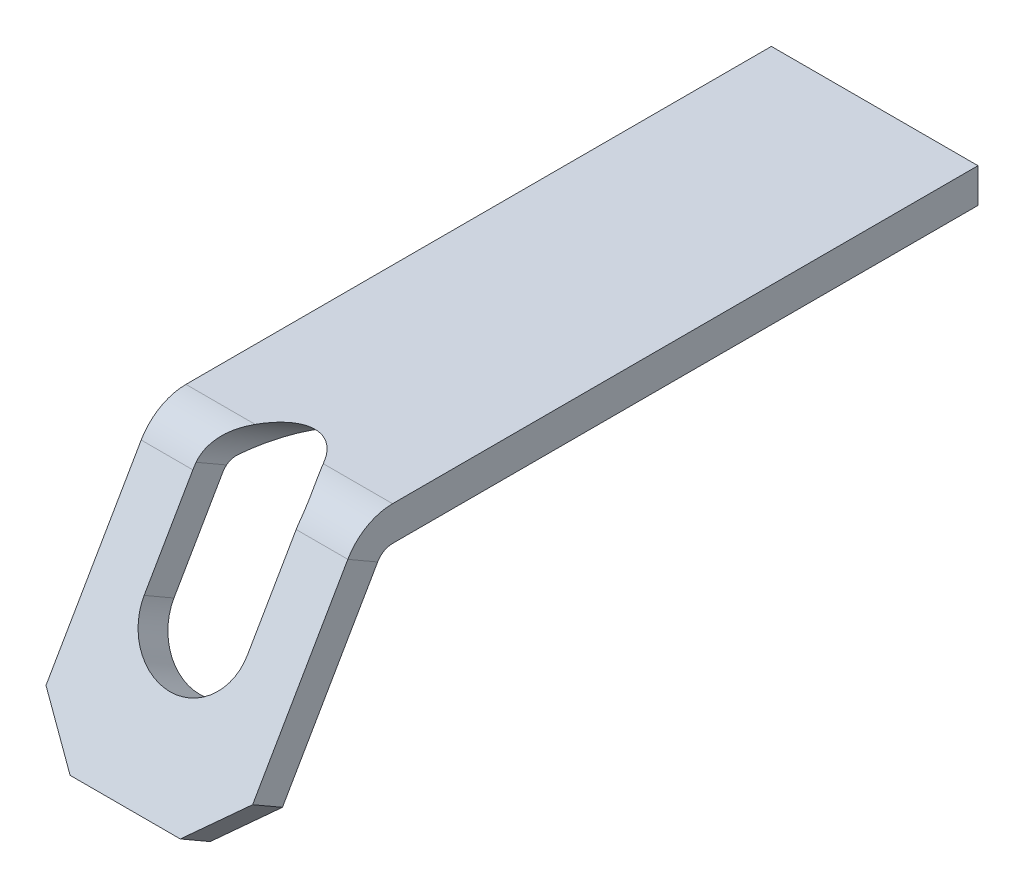
ISO-10303-21;
HEADER;
FILE_DESCRIPTION(('STEP AP214'),'2;1');
FILE_NAME('part.step','',(''),(''),'','','');
FILE_SCHEMA(('AUTOMOTIVE_DESIGN { 1 0 10303 214 1 1 1 1 }'));
ENDSEC;
DATA;
#1=APPLICATION_CONTEXT('core data for automotive mechanical design processes');
#2=APPLICATION_PROTOCOL_DEFINITION('international standard','automotive_design',2000,#1);
#3=PRODUCT_CONTEXT('',#1,'mechanical');
#4=PRODUCT('Part','Part','',(#3));
#5=PRODUCT_RELATED_PRODUCT_CATEGORY('part','',(#4));
#6=PRODUCT_DEFINITION_FORMATION('','',#4);
#7=PRODUCT_DEFINITION_CONTEXT('part definition',#1,'design');
#8=PRODUCT_DEFINITION('design','',#6,#7);
#9=PRODUCT_DEFINITION_SHAPE('','',#8);
#10=(LENGTH_UNIT() NAMED_UNIT(*) SI_UNIT(.MILLI.,.METRE.));
#11=(NAMED_UNIT(*) PLANE_ANGLE_UNIT() SI_UNIT($,.RADIAN.));
#12=(NAMED_UNIT(*) SI_UNIT($,.STERADIAN.) SOLID_ANGLE_UNIT());
#13=UNCERTAINTY_MEASURE_WITH_UNIT(LENGTH_MEASURE(1.E-05),#10,'distance_accuracy_value','');
#14=(GEOMETRIC_REPRESENTATION_CONTEXT(3) GLOBAL_UNCERTAINTY_ASSIGNED_CONTEXT((#13)) GLOBAL_UNIT_ASSIGNED_CONTEXT((#10,
#11,#12)) REPRESENTATION_CONTEXT('',''));
#15=CARTESIAN_POINT('',(0.,0.,0.));
#16=DIRECTION('',(0.,0.,1.));
#17=DIRECTION('',(1.,0.,0.));
#18=AXIS2_PLACEMENT_3D('',#15,#16,#17);
#19=CARTESIAN_POINT('',(0.,-0.5,4.25));
#20=DIRECTION('',(1.,0.,0.));
#21=DIRECTION('',(0.,0.,-1.));
#22=AXIS2_PLACEMENT_3D('',#19,#20,#21);
#23=CYLINDRICAL_SURFACE('',#22,0.25);
#24=CARTESIAN_POINT('',(0.738540154084688,-0.25,4.25));
#25=CARTESIAN_POINT('',(0.739796227190586,-0.249992222476748,4.26423192600012));
#26=CARTESIAN_POINT('',(0.741136393695474,-0.251215674942695,4.27845228618072));
#27=CARTESIAN_POINT('',(0.743704492818735,-0.255982139403662,4.30608304503192));
#28=CARTESIAN_POINT('',(0.74493454642555,-0.2594573169147,4.31950497559517));
#29=CARTESIAN_POINT('',(0.747172335123278,-0.268891956089954,4.34646595481917));
#30=CARTESIAN_POINT('',(0.748160348429003,-0.274998607282581,4.35995559261057));
#31=CARTESIAN_POINT('',(0.749588900459598,-0.289725386987503,4.38608332336731));
#32=CARTESIAN_POINT('',(0.750011148585141,-0.298418856822308,4.3986810266524));
#33=CARTESIAN_POINT('',(0.75,-0.308220009215909,4.41037591818866));
#34=B_SPLINE_CURVE_WITH_KNOTS('',3,(#24,#25,#26,#27,#28,#29,#30,#31,#32,#33),.UNSPECIFIED.,.F.,
.F.,(4,2,2,2,4),(0.,0.0428026914059938,0.0843723717900828,0.128652135829097,0.174331417159321),.UNSPECIFIED.);
#35=CARTESIAN_POINT('',(0.738540154084688,-0.25,4.25));
#36=VERTEX_POINT('',#35);
#37=CARTESIAN_POINT('',(0.75,-0.308220009215908,4.41037591818866));
#38=VERTEX_POINT('',#37);
#39=EDGE_CURVE('E316',#36,#38,#34,.T.);
#40=ORIENTED_EDGE('',*,*,#39,.F.);
#41=DIRECTION('',(1.,0.,0.));
#42=VECTOR('',#41,1.);
#43=CARTESIAN_POINT('',(-1.5,-0.25,4.25));
#44=LINE('',#43,#42);
#45=CARTESIAN_POINT('',(1.5,-0.25,4.25));
#46=VERTEX_POINT('',#45);
#47=EDGE_CURVE('E315',#36,#46,#44,.T.);
#48=ORIENTED_EDGE('',*,*,#47,.T.);
#49=CARTESIAN_POINT('',(1.5,-0.5,4.25));
#50=DIRECTION('',(1.,0.,0.));
#51=DIRECTION('',(0.,1.,0.));
#52=AXIS2_PLACEMENT_3D('',#49,#50,#51);
#53=CIRCLE('',#52,0.25);
#54=CARTESIAN_POINT('',(1.5,-0.375,4.46650635094611));
#55=VERTEX_POINT('',#54);
#56=EDGE_CURVE('E341',#46,#55,#53,.T.);
#57=ORIENTED_EDGE('',*,*,#56,.T.);
#58=DIRECTION('',(1.,0.,0.));
#59=VECTOR('',#58,1.);
#60=CARTESIAN_POINT('',(-1.5,-0.375,4.46650635094611));
#61=LINE('',#60,#59);
#62=CARTESIAN_POINT('',(0.75,-0.375,4.46650635094611));
#63=VERTEX_POINT('',#62);
#64=EDGE_CURVE('E330',#63,#55,#61,.T.);
#65=ORIENTED_EDGE('',*,*,#64,.F.);
#66=CARTESIAN_POINT('',(0.75,-0.5,4.25));
#67=DIRECTION('',(1.,0.,0.));
#68=DIRECTION('',(0.,0.,-1.));
#69=AXIS2_PLACEMENT_3D('',#66,#67,#68);
#70=CIRCLE('',#69,0.25);
#71=EDGE_CURVE('E204',#38,#63,#70,.T.);
#72=ORIENTED_EDGE('',*,*,#71,.F.);
#73=EDGE_LOOP('',(#40,#48,#57,#65,#72));
#74=FACE_BOUND('',#73,.T.);
#75=ADVANCED_FACE('F33',(#74),#23,.F.);
#76=CARTESIAN_POINT('',(0.,-0.5,4.25));
#77=DIRECTION('',(1.,0.,0.));
#78=DIRECTION('',(0.,0.,-1.));
#79=AXIS2_PLACEMENT_3D('',#76,#77,#78);
#80=CYLINDRICAL_SURFACE('',#79,0.75);
#81=CARTESIAN_POINT('',(0.75,-0.0530774463347981,4.85229580027208));
#82=CARTESIAN_POINT('',(0.750002475309161,-0.0390500007812527,4.84189012408484));
#83=CARTESIAN_POINT('',(0.749397484850658,-0.0253996458115997,4.83099771523583));
#84=CARTESIAN_POINT('',(0.747030547301498,0.00104006971930772,4.8083555069125));
#85=CARTESIAN_POINT('',(0.745269813605595,0.0138303177827564,4.79660661812892));
#86=CARTESIAN_POINT('',(0.738388136393959,0.0505308719127275,4.7604737016062));
#87=CARTESIAN_POINT('',(0.731665075692414,0.0730740166895009,4.73497676608455));
#88=CARTESIAN_POINT('',(0.714670479663492,0.113924752364809,4.68210224166803));
#89=CARTESIAN_POINT('',(0.704412929418581,0.132248568388786,4.65473240041221));
#90=CARTESIAN_POINT('',(0.681092480512217,0.164811508788652,4.59868326911695));
#91=CARTESIAN_POINT('',(0.668020265449992,0.179036692146175,4.56999988576025));
#92=CARTESIAN_POINT('',(0.63361768347433,0.2088635379017,4.49914580377907));
#93=CARTESIAN_POINT('',(0.611187373419911,0.222307050936848,4.45660414355653));
#94=CARTESIAN_POINT('',(0.564129396140941,0.241456718121171,4.37110856302409));
#95=CARTESIAN_POINT('',(0.539503361307708,0.247168570016325,4.3281549698181));
#96=CARTESIAN_POINT('',(0.508168812013807,0.249724148600028,4.27340370863223));
#97=CARTESIAN_POINT('',(0.501476538124168,0.249996949131605,4.26170462495713));
#98=CARTESIAN_POINT('',(0.494804752028709,0.250000000000006,4.25));
#99=B_SPLINE_CURVE_WITH_KNOTS('',3,(#81,#82,#83,#84,#85,#86,#87,#88,#89,#90,#91,#92,#93,#94,#95,
#96,#97,#98),.UNSPECIFIED.,.F.,.F.,(4,2,2,2,2,2,2,2,4),(0.,0.0523524240966635,0.104649972016483,
0.208128032232243,0.311201270134959,0.4146210689264,0.563636486235141,0.712542028697262,
0.752971410406567),.UNSPECIFIED.);
#100=CARTESIAN_POINT('',(0.75,-0.0530774463347985,4.85229580027207));
#101=VERTEX_POINT('',#100);
#102=CARTESIAN_POINT('',(0.494804752028707,0.25,4.25));
#103=VERTEX_POINT('',#102);
#104=EDGE_CURVE('E241',#101,#103,#99,.T.);
#105=ORIENTED_EDGE('',*,*,#104,.F.);
#106=CARTESIAN_POINT('',(0.75,-0.5,4.25));
#107=DIRECTION('',(1.,0.,0.));
#108=DIRECTION('',(0.,0.,-1.));
#109=AXIS2_PLACEMENT_3D('',#106,#107,#108);
#110=CIRCLE('',#109,0.75);
#111=CARTESIAN_POINT('',(0.75,-0.125000000000001,4.89951905283833));
#112=VERTEX_POINT('',#111);
#113=EDGE_CURVE('E206',#112,#101,#110,.F.);
#114=ORIENTED_EDGE('',*,*,#113,.F.);
#115=DIRECTION('',(-1.,0.,0.));
#116=VECTOR('',#115,1.);
#117=CARTESIAN_POINT('',(1.5,-0.125000000000001,4.89951905283833));
#118=LINE('',#117,#116);
#119=CARTESIAN_POINT('',(1.5,-0.125000000000001,4.89951905283833));
#120=VERTEX_POINT('',#119);
#121=EDGE_CURVE('E338',#120,#112,#118,.T.);
#122=ORIENTED_EDGE('',*,*,#121,.F.);
#123=CARTESIAN_POINT('',(1.5,-0.5,4.25));
#124=DIRECTION('',(1.,0.,0.));
#125=DIRECTION('',(0.,1.,0.));
#126=AXIS2_PLACEMENT_3D('',#123,#124,#125);
#127=CIRCLE('',#126,0.75);
#128=CARTESIAN_POINT('',(1.5,0.25,4.25));
#129=VERTEX_POINT('',#128);
#130=EDGE_CURVE('E352',#129,#120,#127,.T.);
#131=ORIENTED_EDGE('',*,*,#130,.F.);
#132=DIRECTION('',(1.,0.,0.));
#133=VECTOR('',#132,1.);
#134=CARTESIAN_POINT('',(-1.5,0.25,4.25));
#135=LINE('',#134,#133);
#136=EDGE_CURVE('E369',#103,#129,#135,.T.);
#137=ORIENTED_EDGE('',*,*,#136,.F.);
#138=EDGE_LOOP('',(#105,#114,#122,#131,#137));
#139=FACE_BOUND('',#138,.T.);
#140=ADVANCED_FACE('F254',(#139),#80,.T.);
#141=CARTESIAN_POINT('',(1.5,0.25,-4.25));
#142=DIRECTION('',(-1.,0.,0.));
#143=DIRECTION('',(0.,0.,1.));
#144=AXIS2_PLACEMENT_3D('',#141,#142,#143);
#145=PLANE('',#144);
#146=DIRECTION('',(0.,0.,-1.));
#147=VECTOR('',#146,1.);
#148=CARTESIAN_POINT('',(1.5,-0.25,-4.25));
#149=LINE('',#148,#147);
#150=CARTESIAN_POINT('',(1.5,-0.25,-4.25));
#151=VERTEX_POINT('',#150);
#152=EDGE_CURVE('E361',#46,#151,#149,.T.);
#153=ORIENTED_EDGE('',*,*,#152,.T.);
#154=DIRECTION('',(0.,-1.,0.));
#155=VECTOR('',#154,1.);
#156=CARTESIAN_POINT('',(1.5,0.25,-4.25));
#157=LINE('',#156,#155);
#158=CARTESIAN_POINT('',(1.5,0.25,-4.25));
#159=VERTEX_POINT('',#158);
#160=EDGE_CURVE('E182',#159,#151,#157,.T.);
#161=ORIENTED_EDGE('',*,*,#160,.F.);
#162=DIRECTION('',(0.,0.,-1.));
#163=VECTOR('',#162,1.);
#164=CARTESIAN_POINT('',(1.5,0.25,-4.25));
#165=LINE('',#164,#163);
#166=EDGE_CURVE('E362',#129,#159,#165,.T.);
#167=ORIENTED_EDGE('',*,*,#166,.F.);
#168=ORIENTED_EDGE('',*,*,#130,.T.);
#169=DIRECTION('',(0.,0.5,0.866025403784439));
#170=VECTOR('',#169,1.);
#171=CARTESIAN_POINT('',(1.5,-0.375,4.46650635094611));
#172=LINE('',#171,#170);
#173=EDGE_CURVE('E344',#55,#120,#172,.T.);
#174=ORIENTED_EDGE('',*,*,#173,.F.);
#175=ORIENTED_EDGE('',*,*,#56,.F.);
#176=EDGE_LOOP('',(#153,#161,#167,#168,#174,#175));
#177=FACE_BOUND('',#176,.T.);
#178=ADVANCED_FACE('F277',(#177),#145,.F.);
#179=CARTESIAN_POINT('',(-1.5,0.25,-4.25));
#180=DIRECTION('',(0.,0.,1.));
#181=DIRECTION('',(1.,0.,0.));
#182=AXIS2_PLACEMENT_3D('',#179,#180,#181);
#183=PLANE('',#182);
#184=DIRECTION('',(-1.,0.,0.));
#185=VECTOR('',#184,1.);
#186=CARTESIAN_POINT('',(-1.5,-0.25,-4.25));
#187=LINE('',#186,#185);
#188=CARTESIAN_POINT('',(-1.5,-0.25,-4.25));
#189=VERTEX_POINT('',#188);
#190=EDGE_CURVE('E376',#151,#189,#187,.T.);
#191=ORIENTED_EDGE('',*,*,#190,.T.);
#192=DIRECTION('',(0.,-1.,0.));
#193=VECTOR('',#192,1.);
#194=CARTESIAN_POINT('',(-1.5,0.25,-4.25));
#195=LINE('',#194,#193);
#196=CARTESIAN_POINT('',(-1.5,0.25,-4.25));
#197=VERTEX_POINT('',#196);
#198=EDGE_CURVE('E373',#197,#189,#195,.T.);
#199=ORIENTED_EDGE('',*,*,#198,.F.);
#200=DIRECTION('',(-1.,0.,0.));
#201=VECTOR('',#200,1.);
#202=CARTESIAN_POINT('',(-1.5,0.25,-4.25));
#203=LINE('',#202,#201);
#204=EDGE_CURVE('E365',#159,#197,#203,.T.);
#205=ORIENTED_EDGE('',*,*,#204,.F.);
#206=ORIENTED_EDGE('',*,*,#160,.T.);
#207=EDGE_LOOP('',(#191,#199,#205,#206));
#208=FACE_BOUND('',#207,.T.);
#209=ADVANCED_FACE('F273',(#208),#183,.F.);
#210=CARTESIAN_POINT('',(-1.5,0.25,-4.25));
#211=DIRECTION('',(1.,0.,0.));
#212=DIRECTION('',(0.,0.,-1.));
#213=AXIS2_PLACEMENT_3D('',#210,#211,#212);
#214=PLANE('',#213);
#215=DIRECTION('',(0.,0.,1.));
#216=VECTOR('',#215,1.);
#217=CARTESIAN_POINT('',(-1.5,-0.25,-4.25));
#218=LINE('',#217,#216);
#219=CARTESIAN_POINT('',(-1.5,-0.25,4.25));
#220=VERTEX_POINT('',#219);
#221=EDGE_CURVE('E378',#189,#220,#218,.T.);
#222=ORIENTED_EDGE('',*,*,#221,.T.);
#223=CARTESIAN_POINT('',(-1.5,-0.5,4.25));
#224=DIRECTION('',(1.,0.,0.));
#225=DIRECTION('',(0.,1.,0.));
#226=AXIS2_PLACEMENT_3D('',#223,#224,#225);
#227=CIRCLE('',#226,0.25);
#228=CARTESIAN_POINT('',(-1.5,-0.375,4.46650635094611));
#229=VERTEX_POINT('',#228);
#230=EDGE_CURVE('E328',#220,#229,#227,.T.);
#231=ORIENTED_EDGE('',*,*,#230,.T.);
#232=DIRECTION('',(0.,-0.5,-0.866025403784439));
#233=VECTOR('',#232,1.);
#234=CARTESIAN_POINT('',(-1.5,-0.125000000000001,4.89951905283833));
#235=LINE('',#234,#233);
#236=CARTESIAN_POINT('',(-1.5,-0.125000000000001,4.89951905283833));
#237=VERTEX_POINT('',#236);
#238=EDGE_CURVE('E320',#237,#229,#235,.T.);
#239=ORIENTED_EDGE('',*,*,#238,.F.);
#240=CARTESIAN_POINT('',(-1.5,-0.5,4.25));
#241=DIRECTION('',(1.,0.,0.));
#242=DIRECTION('',(0.,1.,0.));
#243=AXIS2_PLACEMENT_3D('',#240,#241,#242);
#244=CIRCLE('',#243,0.75);
#245=CARTESIAN_POINT('',(-1.5,0.25,4.25));
#246=VERTEX_POINT('',#245);
#247=EDGE_CURVE('E317',#246,#237,#244,.T.);
#248=ORIENTED_EDGE('',*,*,#247,.F.);
#249=DIRECTION('',(0.,0.,1.));
#250=VECTOR('',#249,1.);
#251=CARTESIAN_POINT('',(-1.5,0.25,-4.25));
#252=LINE('',#251,#250);
#253=EDGE_CURVE('E367',#197,#246,#252,.T.);
#254=ORIENTED_EDGE('',*,*,#253,.F.);
#255=ORIENTED_EDGE('',*,*,#198,.T.);
#256=EDGE_LOOP('',(#222,#231,#239,#248,#254,#255));
#257=FACE_BOUND('',#256,.T.);
#258=ADVANCED_FACE('F266',(#257),#214,.F.);
#259=CARTESIAN_POINT('',(0.,0.25,0.));
#260=DIRECTION('',(0.,1.,0.));
#261=DIRECTION('',(0.,0.,1.));
#262=AXIS2_PLACEMENT_3D('',#259,#260,#261);
#263=PLANE('',#262);
#264=CARTESIAN_POINT('',(0.,0.25,5.37724133595217));
#265=DIRECTION('',(0.,1.,0.));
#266=DIRECTION('',(0.,0.,1.));
#267=AXIS2_PLACEMENT_3D('',#264,#265,#266);
#268=ELLIPSE('',#267,1.5,0.75);
#269=CARTESIAN_POINT('',(-0.494804752028707,0.25,4.25));
#270=VERTEX_POINT('',#269);
#271=EDGE_CURVE('E208',#103,#270,#268,.T.);
#272=ORIENTED_EDGE('',*,*,#271,.F.);
#273=ORIENTED_EDGE('',*,*,#136,.T.);
#274=ORIENTED_EDGE('',*,*,#166,.T.);
#275=ORIENTED_EDGE('',*,*,#204,.T.);
#276=ORIENTED_EDGE('',*,*,#253,.T.);
#277=EDGE_CURVE('E370',#246,#270,#135,.T.);
#278=ORIENTED_EDGE('',*,*,#277,.T.);
#279=EDGE_LOOP('',(#272,#273,#274,#275,#276,#278));
#280=FACE_BOUND('',#279,.T.);
#281=ADVANCED_FACE('F263',(#280),#263,.T.);
#282=CARTESIAN_POINT('',(0.,-0.25,0.));
#283=DIRECTION('',(0.,1.,0.));
#284=DIRECTION('',(0.,0.,1.));
#285=AXIS2_PLACEMENT_3D('',#282,#283,#284);
#286=PLANE('',#285);
#287=ORIENTED_EDGE('',*,*,#47,.F.);
#288=CARTESIAN_POINT('',(0.,-0.25,4.51121593216774));
#289=DIRECTION('',(0.,1.,0.));
#290=DIRECTION('',(0.,0.,1.));
#291=AXIS2_PLACEMENT_3D('',#288,#289,#290);
#292=ELLIPSE('',#291,1.5,0.75);
#293=CARTESIAN_POINT('',(-0.738540154084688,-0.25,4.25));
#294=VERTEX_POINT('',#293);
#295=EDGE_CURVE('E217',#36,#294,#292,.T.);
#296=ORIENTED_EDGE('',*,*,#295,.T.);
#297=EDGE_CURVE('E308',#220,#294,#44,.T.);
#298=ORIENTED_EDGE('',*,*,#297,.F.);
#299=ORIENTED_EDGE('',*,*,#221,.F.);
#300=ORIENTED_EDGE('',*,*,#190,.F.);
#301=ORIENTED_EDGE('',*,*,#152,.F.);
#302=EDGE_LOOP('',(#287,#296,#298,#299,#300,#301));
#303=FACE_BOUND('',#302,.T.);
#304=ADVANCED_FACE('F259',(#303),#286,.F.);
#305=CARTESIAN_POINT('',(0.,-3.25,6.4150635094611));
#306=DIRECTION('',(0.,-0.866025403784438,0.500000000000001));
#307=DIRECTION('',(1.,0.,0.));
#308=AXIS2_PLACEMENT_3D('',#305,#306,#307);
#309=PLANE('',#308);
#310=DIRECTION('',(1.,0.,0.));
#311=VECTOR('',#310,1.);
#312=CARTESIAN_POINT('',(-1.5,-3.375,6.198557158515));
#313=LINE('',#312,#311);
#314=CARTESIAN_POINT('',(-0.799999999999998,-3.375,6.198557158515));
#315=VERTEX_POINT('',#314);
#316=CARTESIAN_POINT('',(0.8,-3.375,6.198557158515));
#317=VERTEX_POINT('',#316);
#318=EDGE_CURVE('E334',#315,#317,#313,.T.);
#319=ORIENTED_EDGE('',*,*,#318,.T.);
#320=DIRECTION('',(0.,0.500000000000001,0.866025403784438));
#321=VECTOR('',#320,1.);
#322=CARTESIAN_POINT('',(0.8,-3.25,6.4150635094611));
#323=LINE('',#322,#321);
#324=CARTESIAN_POINT('',(0.8,-3.125,6.63156986040721));
#325=VERTEX_POINT('',#324);
#326=EDGE_CURVE('E400',#317,#325,#323,.T.);
#327=ORIENTED_EDGE('',*,*,#326,.T.);
#328=DIRECTION('',(-1.,0.,0.));
#329=VECTOR('',#328,1.);
#330=CARTESIAN_POINT('',(1.5,-3.125,6.63156986040721));
#331=LINE('',#330,#329);
#332=CARTESIAN_POINT('',(-0.799999999999998,-3.125,6.63156986040721));
#333=VERTEX_POINT('',#332);
#334=EDGE_CURVE('E357',#325,#333,#331,.T.);
#335=ORIENTED_EDGE('',*,*,#334,.T.);
#336=DIRECTION('',(0.,-0.500000000000001,-0.866025403784438));
#337=VECTOR('',#336,1.);
#338=CARTESIAN_POINT('',(-0.799999999999998,-3.25,6.4150635094611));
#339=LINE('',#338,#337);
#340=EDGE_CURVE('E246',#333,#315,#339,.T.);
#341=ORIENTED_EDGE('',*,*,#340,.T.);
#342=EDGE_LOOP('',(#319,#327,#335,#341));
#343=FACE_BOUND('',#342,.T.);
#344=ADVANCED_FACE('F229',(#343),#309,.T.);
#345=CARTESIAN_POINT('',(-0.75,-0.308220009215908,4.41037591818866));
#346=CARTESIAN_POINT('',(-0.750008310530121,-0.299170345690206,4.39957110118343));
#347=CARTESIAN_POINT('',(-0.7496493719506,-0.291061551564701,4.38799997393136));
#348=CARTESIAN_POINT('',(-0.748415678099862,-0.277104423632904,4.36403100034418));
#349=CARTESIAN_POINT('',(-0.747555891577427,-0.271198332145317,4.35166604883466));
#350=CARTESIAN_POINT('',(-0.745421239101967,-0.261037124809497,4.32496342703673));
#351=CARTESIAN_POINT('',(-0.744115010283401,-0.256988760900442,4.31054949871758));
#352=CARTESIAN_POINT('',(-0.741355473168162,-0.25142101625551,4.28077071335262));
#353=CARTESIAN_POINT('',(-0.739898791250124,-0.249986913345264,4.26539018443887));
#354=CARTESIAN_POINT('',(-0.738540154084688,-0.25,4.25));
#355=B_SPLINE_CURVE_WITH_KNOTS('',3,(#345,#346,#347,#348,#349,#350,#351,#352,#353,#354),
.UNSPECIFIED.,.F.,.F.,(4,2,2,2,4),(0.,0.0422016336722642,0.0832023760305246,0.128047888733355,
0.174331752280167),.UNSPECIFIED.);
#356=CARTESIAN_POINT('',(-0.75,-0.308220009215908,4.41037591818866));
#357=VERTEX_POINT('',#356);
#358=EDGE_CURVE('E210',#357,#294,#355,.T.);
#359=ORIENTED_EDGE('',*,*,#358,.F.);
#360=CARTESIAN_POINT('',(-0.75,-0.5,4.25));
#361=DIRECTION('',(-1.,0.,0.));
#362=DIRECTION('',(0.,-1.,0.));
#363=AXIS2_PLACEMENT_3D('',#360,#361,#362);
#364=CIRCLE('',#363,0.25);
#365=CARTESIAN_POINT('',(-0.75,-0.375,4.46650635094611));
#366=VERTEX_POINT('',#365);
#367=EDGE_CURVE('E198',#366,#357,#364,.T.);
#368=ORIENTED_EDGE('',*,*,#367,.F.);
#369=EDGE_CURVE('E339',#229,#366,#61,.T.);
#370=ORIENTED_EDGE('',*,*,#369,.F.);
#371=ORIENTED_EDGE('',*,*,#230,.F.);
#372=ORIENTED_EDGE('',*,*,#297,.T.);
#373=EDGE_LOOP('',(#359,#368,#370,#371,#372));
#374=FACE_BOUND('',#373,.T.);
#375=ADVANCED_FACE('F219',(#374),#23,.F.);
#376=CARTESIAN_POINT('',(-0.494804752028707,0.25,4.25));
#377=CARTESIAN_POINT('',(-0.507212223849995,0.24999104936502,4.27176544478382));
#378=CARTESIAN_POINT('',(-0.519677329562981,0.249052174133644,4.29348153759597));
#379=CARTESIAN_POINT('',(-0.544476505895984,0.245273819176751,4.33686353730328));
#380=CARTESIAN_POINT('',(-0.556810364065535,0.242431628285439,4.35852932830796));
#381=CARTESIAN_POINT('',(-0.593492984985001,0.230897623169133,4.42397071088134));
#382=CARTESIAN_POINT('',(-0.617199549117097,0.219196023208876,4.46764754407431));
#383=CARTESIAN_POINT('',(-0.655369353049871,0.191156681794535,4.54326612847591));
#384=CARTESIAN_POINT('',(-0.670675057728904,0.176653514513336,4.57546468892482));
#385=CARTESIAN_POINT('',(-0.697958612412823,0.142647605295805,4.63828922937357));
#386=CARTESIAN_POINT('',(-0.70996212874235,0.123185827280292,4.66892573721418));
#387=CARTESIAN_POINT('',(-0.729340509733132,0.0800406667948656,4.72675752132392));
#388=CARTESIAN_POINT('',(-0.736878604418717,0.0565530386505959,4.75404068185705));
#389=CARTESIAN_POINT('',(-0.744635583122395,0.0179834450445735,4.79270929564723));
#390=CARTESIAN_POINT('',(-0.746630830911752,0.00444936512402553,4.80531366677174));
#391=CARTESIAN_POINT('',(-0.749315579530813,-0.0236048687245404,4.82956257178275));
#392=CARTESIAN_POINT('',(-0.750003338619623,-0.0381263113268377,4.84120580560175));
#393=CARTESIAN_POINT('',(-0.75,-0.0530774463347993,4.85229580027208));
#394=B_SPLINE_CURVE_WITH_KNOTS('',3,(#376,#377,#378,#379,#380,#381,#382,#383,#384,#385,#386,
#387,#388,#389,#390,#391,#392,#393),.UNSPECIFIED.,.F.,.F.,(4,2,2,2,2,2,2,2,4),(0.,
0.0751135104377852,0.150334244069228,0.302651785589941,0.417705443137115,0.531837811097346,
0.641489009411778,0.697207014432039,0.752999191038594),.UNSPECIFIED.);
#395=CARTESIAN_POINT('',(-0.75,-0.0530774463347985,4.85229580027207));
#396=VERTEX_POINT('',#395);
#397=EDGE_CURVE('E181',#270,#396,#394,.T.);
#398=ORIENTED_EDGE('',*,*,#397,.F.);
#399=ORIENTED_EDGE('',*,*,#277,.F.);
#400=ORIENTED_EDGE('',*,*,#247,.T.);
#401=CARTESIAN_POINT('',(-0.75,-0.125000000000001,4.89951905283833));
#402=VERTEX_POINT('',#401);
#403=EDGE_CURVE('E355',#402,#237,#118,.T.);
#404=ORIENTED_EDGE('',*,*,#403,.F.);
#405=CARTESIAN_POINT('',(-0.75,-0.5,4.25));
#406=DIRECTION('',(-1.,0.,0.));
#407=DIRECTION('',(0.,-1.,0.));
#408=AXIS2_PLACEMENT_3D('',#405,#406,#407);
#409=CIRCLE('',#408,0.75);
#410=EDGE_CURVE('E178',#396,#402,#409,.F.);
#411=ORIENTED_EDGE('',*,*,#410,.F.);
#412=EDGE_LOOP('',(#398,#399,#400,#404,#411));
#413=FACE_BOUND('',#412,.T.);
#414=ADVANCED_FACE('F248',(#413),#80,.T.);
#415=CARTESIAN_POINT('',(-1.5,-0.125,4.89951905283833));
#416=DIRECTION('',(-1.,0.,0.));
#417=DIRECTION('',(0.,0.,1.));
#418=AXIS2_PLACEMENT_3D('',#415,#416,#417);
#419=PLANE('',#418);
#420=DIRECTION('',(0.,-0.866025403784438,0.500000000000001));
#421=VECTOR('',#420,1.);
#422=CARTESIAN_POINT('',(-1.5,-0.375,4.46650635094611));
#423=LINE('',#422,#421);
#424=CARTESIAN_POINT('',(-1.5,-2.76878221735089,5.84855715851499));
#425=VERTEX_POINT('',#424);
#426=EDGE_CURVE('E332',#229,#425,#423,.T.);
#427=ORIENTED_EDGE('',*,*,#426,.T.);
#428=DIRECTION('',(0.,0.500000000000001,0.866025403784438));
#429=VECTOR('',#428,1.);
#430=CARTESIAN_POINT('',(-1.5,-2.51878221735089,6.28156986040721));
#431=LINE('',#430,#429);
#432=CARTESIAN_POINT('',(-1.5,-2.51878221735089,6.28156986040721));
#433=VERTEX_POINT('',#432);
#434=EDGE_CURVE('E11',#425,#433,#431,.T.);
#435=ORIENTED_EDGE('',*,*,#434,.T.);
#436=DIRECTION('',(0.,-0.866025403784438,0.500000000000001));
#437=VECTOR('',#436,1.);
#438=CARTESIAN_POINT('',(-1.5,-0.125,4.89951905283833));
#439=LINE('',#438,#437);
#440=EDGE_CURVE('E335',#237,#433,#439,.T.);
#441=ORIENTED_EDGE('',*,*,#440,.F.);
#442=ORIENTED_EDGE('',*,*,#238,.T.);
#443=EDGE_LOOP('',(#427,#435,#441,#442));
#444=FACE_BOUND('',#443,.T.);
#445=ADVANCED_FACE('F231',(#444),#419,.T.);
#446=CARTESIAN_POINT('',(-1.5,-0.375,4.46650635094611));
#447=DIRECTION('',(0.,-0.500000000000001,-0.866025403784438));
#448=DIRECTION('',(0.,0.866025403784438,-0.500000000000001));
#449=AXIS2_PLACEMENT_3D('',#446,#447,#448);
#450=PLANE('',#449);
#451=DIRECTION('',(0.,-0.866025403784438,0.500000000000001));
#452=VECTOR('',#451,1.);
#453=CARTESIAN_POINT('',(1.5,-0.375,4.46650635094611));
#454=LINE('',#453,#452);
#455=CARTESIAN_POINT('',(1.5,-2.76878221735089,5.84855715851499));
#456=VERTEX_POINT('',#455);
#457=EDGE_CURVE('E347',#55,#456,#454,.T.);
#458=ORIENTED_EDGE('',*,*,#457,.T.);
#459=DIRECTION('',(0.707106781186546,0.612372435695796,-0.353553390593275));
#460=VECTOR('',#459,1.);
#461=CARTESIAN_POINT('',(1.38205080756888,-2.8709292143521,5.90753175473055));
#462=LINE('',#461,#460);
#463=EDGE_CURVE('E41',#456,#317,#462,.F.);
#464=ORIENTED_EDGE('',*,*,#463,.T.);
#465=ORIENTED_EDGE('',*,*,#318,.F.);
#466=DIRECTION('',(0.707106781186546,-0.612372435695796,0.353553390593275));
#467=VECTOR('',#466,1.);
#468=CARTESIAN_POINT('',(-2.88205080756888,-1.57189110867544,5.15753175473055));
#469=LINE('',#468,#467);
#470=EDGE_CURVE('E48',#315,#425,#469,.F.);
#471=ORIENTED_EDGE('',*,*,#470,.T.);
#472=ORIENTED_EDGE('',*,*,#426,.F.);
#473=ORIENTED_EDGE('',*,*,#369,.T.);
#474=DIRECTION('',(0.,0.866025403784438,-0.500000000000001));
#475=VECTOR('',#474,1.);
#476=CARTESIAN_POINT('',(-0.75,-0.375,4.46650635094611));
#477=LINE('',#476,#475);
#478=CARTESIAN_POINT('',(-0.75,-1.5996479222419,5.17355715851499));
#479=VERTEX_POINT('',#478);
#480=EDGE_CURVE('E194',#479,#366,#477,.T.);
#481=ORIENTED_EDGE('',*,*,#480,.F.);
#482=CARTESIAN_POINT('',(0.,-1.5996479222419,5.17355715851499));
#483=DIRECTION('',(0.,-0.500000000000001,-0.866025403784438));
#484=DIRECTION('',(0.,0.866025403784438,-0.500000000000001));
#485=AXIS2_PLACEMENT_3D('',#482,#483,#484);
#486=CIRCLE('',#485,0.75);
#487=CARTESIAN_POINT('',(0.75,-1.5996479222419,5.17355715851499));
#488=VERTEX_POINT('',#487);
#489=EDGE_CURVE('E167',#488,#479,#486,.T.);
#490=ORIENTED_EDGE('',*,*,#489,.F.);
#491=DIRECTION('',(0.,-0.866025403784438,0.500000000000001));
#492=VECTOR('',#491,1.);
#493=CARTESIAN_POINT('',(0.75,-0.375,4.46650635094611));
#494=LINE('',#493,#492);
#495=EDGE_CURVE('E202',#63,#488,#494,.T.);
#496=ORIENTED_EDGE('',*,*,#495,.F.);
#497=ORIENTED_EDGE('',*,*,#64,.T.);
#498=EDGE_LOOP('',(#458,#464,#465,#471,#472,#473,#481,#490,#496,#497));
#499=FACE_BOUND('',#498,.T.);
#500=ADVANCED_FACE('F391',(#499),#450,.T.);
#501=CARTESIAN_POINT('',(1.5,-0.375,4.46650635094611));
#502=DIRECTION('',(1.,0.,0.));
#503=DIRECTION('',(0.,0.,-1.));
#504=AXIS2_PLACEMENT_3D('',#501,#502,#503);
#505=PLANE('',#504);
#506=DIRECTION('',(0.,-0.866025403784438,0.500000000000001));
#507=VECTOR('',#506,1.);
#508=CARTESIAN_POINT('',(1.5,-0.125,4.89951905283833));
#509=LINE('',#508,#507);
#510=CARTESIAN_POINT('',(1.5,-2.51878221735089,6.28156986040721));
#511=VERTEX_POINT('',#510);
#512=EDGE_CURVE('E349',#120,#511,#509,.T.);
#513=ORIENTED_EDGE('',*,*,#512,.T.);
#514=DIRECTION('',(0.,-0.500000000000001,-0.866025403784438));
#515=VECTOR('',#514,1.);
#516=CARTESIAN_POINT('',(1.5,-2.76878221735089,5.84855715851499));
#517=LINE('',#516,#515);
#518=EDGE_CURVE('E56',#511,#456,#517,.T.);
#519=ORIENTED_EDGE('',*,*,#518,.T.);
#520=ORIENTED_EDGE('',*,*,#457,.F.);
#521=ORIENTED_EDGE('',*,*,#173,.T.);
#522=EDGE_LOOP('',(#513,#519,#520,#521));
#523=FACE_BOUND('',#522,.T.);
#524=ADVANCED_FACE('F255',(#523),#505,.T.);
#525=CARTESIAN_POINT('',(1.5,-0.125,4.89951905283833));
#526=DIRECTION('',(0.,0.500000000000001,0.866025403784438));
#527=DIRECTION('',(0.,-0.866025403784438,0.500000000000001));
#528=AXIS2_PLACEMENT_3D('',#525,#526,#527);
#529=PLANE('',#528);
#530=ORIENTED_EDGE('',*,*,#334,.F.);
#531=DIRECTION('',(-0.707106781186546,-0.612372435695796,0.353553390593275));
#532=VECTOR('',#531,1.);
#533=CARTESIAN_POINT('',(2.88205080756888,-1.32189110867544,5.59054445662277));
#534=LINE('',#533,#532);
#535=EDGE_CURVE('E399',#325,#511,#534,.F.);
#536=ORIENTED_EDGE('',*,*,#535,.T.);
#537=ORIENTED_EDGE('',*,*,#512,.F.);
#538=ORIENTED_EDGE('',*,*,#121,.T.);
#539=DIRECTION('',(0.,0.866025403784438,-0.500000000000001));
#540=VECTOR('',#539,1.);
#541=CARTESIAN_POINT('',(0.75,-0.0506098165652452,4.85656986040721));
#542=LINE('',#541,#540);
#543=CARTESIAN_POINT('',(0.75,-1.3496479222419,5.60656986040721));
#544=VERTEX_POINT('',#543);
#545=EDGE_CURVE('E187',#544,#112,#542,.T.);
#546=ORIENTED_EDGE('',*,*,#545,.F.);
#547=CARTESIAN_POINT('',(0.,-1.3496479222419,5.60656986040721));
#548=DIRECTION('',(0.,0.500000000000001,0.866025403784438));
#549=DIRECTION('',(0.,-0.866025403784438,0.500000000000001));
#550=AXIS2_PLACEMENT_3D('',#547,#548,#549);
#551=CIRCLE('',#550,0.75);
#552=CARTESIAN_POINT('',(-0.75,-1.3496479222419,5.60656986040721));
#553=VERTEX_POINT('',#552);
#554=EDGE_CURVE('E164',#553,#544,#551,.T.);
#555=ORIENTED_EDGE('',*,*,#554,.F.);
#556=DIRECTION('',(0.,-0.866025403784438,0.500000000000001));
#557=VECTOR('',#556,1.);
#558=CARTESIAN_POINT('',(-0.75,-0.125,4.89951905283833));
#559=LINE('',#558,#557);
#560=EDGE_CURVE('E174',#402,#553,#559,.T.);
#561=ORIENTED_EDGE('',*,*,#560,.F.);
#562=ORIENTED_EDGE('',*,*,#403,.T.);
#563=ORIENTED_EDGE('',*,*,#440,.T.);
#564=DIRECTION('',(-0.707106781186546,0.612372435695796,-0.353553390593275));
#565=VECTOR('',#564,1.);
#566=CARTESIAN_POINT('',(-1.38205080756888,-2.6209292143521,6.34054445662277));
#567=LINE('',#566,#565);
#568=EDGE_CURVE('E398',#433,#333,#567,.F.);
#569=ORIENTED_EDGE('',*,*,#568,.T.);
#570=EDGE_LOOP('',(#530,#536,#537,#538,#546,#555,#561,#562,#563,#569));
#571=FACE_BOUND('',#570,.T.);
#572=ADVANCED_FACE('F185',(#571),#529,.T.);
#573=CARTESIAN_POINT('',(0.,-4.82496778264912,-3.41286071037125));
#574=DIRECTION('',(0.,0.500000000000001,0.866025403784438));
#575=DIRECTION('',(0.,-0.866025403784438,0.500000000000001));
#576=AXIS2_PLACEMENT_3D('',#573,#574,#575);
#577=CYLINDRICAL_SURFACE('',#576,0.75);
#578=ORIENTED_EDGE('',*,*,#39,.T.);
#579=DIRECTION('',(0.,0.500000000000001,0.866025403784438));
#580=VECTOR('',#579,1.);
#581=CARTESIAN_POINT('',(0.75,-4.82496778264912,-3.41286071037125));
#582=LINE('',#581,#580);
#583=EDGE_CURVE('E191',#38,#101,#582,.T.);
#584=ORIENTED_EDGE('',*,*,#583,.T.);
#585=ORIENTED_EDGE('',*,*,#104,.T.);
#586=ORIENTED_EDGE('',*,*,#271,.T.);
#587=ORIENTED_EDGE('',*,*,#397,.T.);
#588=DIRECTION('',(0.,0.500000000000001,0.866025403784438));
#589=VECTOR('',#588,1.);
#590=CARTESIAN_POINT('',(-0.75,-4.82496778264912,-3.41286071037125));
#591=LINE('',#590,#589);
#592=EDGE_CURVE('E171',#357,#396,#591,.T.);
#593=ORIENTED_EDGE('',*,*,#592,.F.);
#594=ORIENTED_EDGE('',*,*,#358,.T.);
#595=ORIENTED_EDGE('',*,*,#295,.F.);
#596=EDGE_LOOP('',(#578,#584,#585,#586,#587,#593,#594,#595));
#597=FACE_BOUND('',#596,.T.);
#598=ADVANCED_FACE('F223',(#597),#577,.F.);
#599=CARTESIAN_POINT('',(0.75,-4.82496778264912,-3.41286071037125));
#600=DIRECTION('',(1.,0.,0.));
#601=DIRECTION('',(0.,0.,-1.));
#602=AXIS2_PLACEMENT_3D('',#599,#600,#601);
#603=PLANE('',#602);
#604=ORIENTED_EDGE('',*,*,#113,.T.);
#605=ORIENTED_EDGE('',*,*,#583,.F.);
#606=ORIENTED_EDGE('',*,*,#71,.T.);
#607=ORIENTED_EDGE('',*,*,#495,.T.);
#608=DIRECTION('',(0.,0.500000000000001,0.866025403784438));
#609=VECTOR('',#608,1.);
#610=CARTESIAN_POINT('',(0.75,-6.12400588832578,-2.66286071037124));
#611=LINE('',#610,#609);
#612=EDGE_CURVE('E170',#488,#544,#611,.T.);
#613=ORIENTED_EDGE('',*,*,#612,.T.);
#614=ORIENTED_EDGE('',*,*,#545,.T.);
#615=EDGE_LOOP('',(#604,#605,#606,#607,#613,#614));
#616=FACE_BOUND('',#615,.T.);
#617=ADVANCED_FACE('F227',(#616),#603,.F.);
#618=CARTESIAN_POINT('',(0.,-6.12400588832578,-2.66286071037124));
#619=DIRECTION('',(0.,0.500000000000001,0.866025403784438));
#620=DIRECTION('',(0.,-0.866025403784438,0.500000000000001));
#621=AXIS2_PLACEMENT_3D('',#618,#619,#620);
#622=CYLINDRICAL_SURFACE('',#621,0.75);
#623=ORIENTED_EDGE('',*,*,#489,.T.);
#624=DIRECTION('',(0.,0.500000000000001,0.866025403784438));
#625=VECTOR('',#624,1.);
#626=CARTESIAN_POINT('',(-0.75,-6.12400588832578,-2.66286071037124));
#627=LINE('',#626,#625);
#628=EDGE_CURVE('E159',#479,#553,#627,.T.);
#629=ORIENTED_EDGE('',*,*,#628,.T.);
#630=ORIENTED_EDGE('',*,*,#554,.T.);
#631=ORIENTED_EDGE('',*,*,#612,.F.);
#632=EDGE_LOOP('',(#623,#629,#630,#631));
#633=FACE_BOUND('',#632,.T.);
#634=ADVANCED_FACE('F161',(#633),#622,.F.);
#635=CARTESIAN_POINT('',(-0.75,-4.82496778264912,-3.41286071037125));
#636=DIRECTION('',(-1.,0.,0.));
#637=DIRECTION('',(0.,-1.,0.));
#638=AXIS2_PLACEMENT_3D('',#635,#636,#637);
#639=PLANE('',#638);
#640=ORIENTED_EDGE('',*,*,#410,.T.);
#641=ORIENTED_EDGE('',*,*,#560,.T.);
#642=ORIENTED_EDGE('',*,*,#628,.F.);
#643=ORIENTED_EDGE('',*,*,#480,.T.);
#644=ORIENTED_EDGE('',*,*,#367,.T.);
#645=ORIENTED_EDGE('',*,*,#592,.T.);
#646=EDGE_LOOP('',(#640,#641,#642,#643,#644,#645));
#647=FACE_BOUND('',#646,.T.);
#648=ADVANCED_FACE('F175',(#647),#639,.F.);
#649=CARTESIAN_POINT('',(0.8,-3.25,6.4150635094611));
#650=DIRECTION('',(-0.707106781186549,0.612372435695793,-0.353553390593274));
#651=DIRECTION('',(0.,0.500000000000001,0.866025403784438));
#652=AXIS2_PLACEMENT_3D('',#649,#650,#651);
#653=PLANE('',#652);
#654=ORIENTED_EDGE('',*,*,#463,.F.);
#655=ORIENTED_EDGE('',*,*,#518,.F.);
#656=ORIENTED_EDGE('',*,*,#535,.F.);
#657=ORIENTED_EDGE('',*,*,#326,.F.);
#658=EDGE_LOOP('',(#654,#655,#656,#657));
#659=FACE_BOUND('',#658,.T.);
#660=ADVANCED_FACE('F281',(#659),#653,.F.);
#661=CARTESIAN_POINT('',(-0.799999999999998,-3.25,6.4150635094611));
#662=DIRECTION('',(0.707106781186549,0.612372435695792,-0.353553390593274));
#663=DIRECTION('',(0.,-0.500000000000001,-0.866025403784438));
#664=AXIS2_PLACEMENT_3D('',#661,#662,#663);
#665=PLANE('',#664);
#666=ORIENTED_EDGE('',*,*,#568,.F.);
#667=ORIENTED_EDGE('',*,*,#434,.F.);
#668=ORIENTED_EDGE('',*,*,#470,.F.);
#669=ORIENTED_EDGE('',*,*,#340,.F.);
#670=EDGE_LOOP('',(#666,#667,#668,#669));
#671=FACE_BOUND('',#670,.T.);
#672=ADVANCED_FACE('F35',(#671),#665,.F.);
#673=CLOSED_SHELL('',(#75,#140,#178,#209,#258,#281,#304,#344,#375,#414,#445,#500,#524,#572,#598,
#617,#634,#648,#660,#672));
#674=MANIFOLD_SOLID_BREP('B2',#673);
#675=ADVANCED_BREP_SHAPE_REPRESENTATION('',(#18,#674),#14);
#676=SHAPE_DEFINITION_REPRESENTATION(#9,#675);
ENDSEC;
END-ISO-10303-21;
